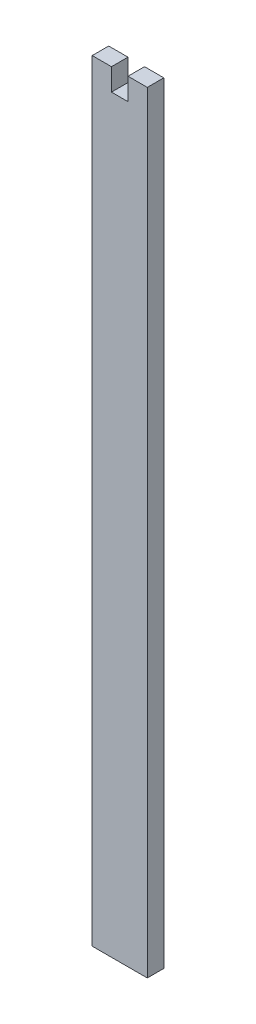
ISO-10303-21;
HEADER;
FILE_DESCRIPTION(('STEP AP214'),'2;1');
FILE_NAME('part.step','',(''),(''),'','','');
FILE_SCHEMA(('AUTOMOTIVE_DESIGN { 1 0 10303 214 1 1 1 1 }'));
ENDSEC;
DATA;
#1=APPLICATION_CONTEXT('core data for automotive mechanical design processes');
#2=APPLICATION_PROTOCOL_DEFINITION('international standard','automotive_design',2000,#1);
#3=PRODUCT_CONTEXT('',#1,'mechanical');
#4=PRODUCT('Part','Part','',(#3));
#5=PRODUCT_RELATED_PRODUCT_CATEGORY('part','',(#4));
#6=PRODUCT_DEFINITION_FORMATION('','',#4);
#7=PRODUCT_DEFINITION_CONTEXT('part definition',#1,'design');
#8=PRODUCT_DEFINITION('design','',#6,#7);
#9=PRODUCT_DEFINITION_SHAPE('','',#8);
#10=(LENGTH_UNIT() NAMED_UNIT(*) SI_UNIT(.MILLI.,.METRE.));
#11=(NAMED_UNIT(*) PLANE_ANGLE_UNIT() SI_UNIT($,.RADIAN.));
#12=(NAMED_UNIT(*) SI_UNIT($,.STERADIAN.) SOLID_ANGLE_UNIT());
#13=UNCERTAINTY_MEASURE_WITH_UNIT(LENGTH_MEASURE(1.E-05),#10,'distance_accuracy_value','');
#14=(GEOMETRIC_REPRESENTATION_CONTEXT(3) GLOBAL_UNCERTAINTY_ASSIGNED_CONTEXT((#13)) GLOBAL_UNIT_ASSIGNED_CONTEXT((#10,
#11,#12)) REPRESENTATION_CONTEXT('',''));
#15=CARTESIAN_POINT('',(0.,0.,0.));
#16=DIRECTION('',(0.,0.,1.));
#17=DIRECTION('',(1.,0.,0.));
#18=AXIS2_PLACEMENT_3D('',#15,#16,#17);
#19=CARTESIAN_POINT('',(4.99999999999999,70.,1.5));
#20=DIRECTION('',(-1.,0.,0.));
#21=DIRECTION('',(0.,-1.,0.));
#22=AXIS2_PLACEMENT_3D('',#19,#20,#21);
#23=PLANE('',#22);
#24=DIRECTION('',(0.,1.,0.));
#25=VECTOR('',#24,1.);
#26=CARTESIAN_POINT('',(4.99999999999999,70.,-1.5));
#27=LINE('',#26,#25);
#28=CARTESIAN_POINT('',(5.00000000000001,-70.,-1.5));
#29=VERTEX_POINT('',#28);
#30=CARTESIAN_POINT('',(4.99999999999999,70.,-1.5));
#31=VERTEX_POINT('',#30);
#32=EDGE_CURVE('E129',#29,#31,#27,.T.);
#33=ORIENTED_EDGE('',*,*,#32,.T.);
#34=DIRECTION('',(0.,0.,-1.));
#35=VECTOR('',#34,1.);
#36=CARTESIAN_POINT('',(4.99999999999999,70.,1.5));
#37=LINE('',#36,#35);
#38=CARTESIAN_POINT('',(4.99999999999999,70.,1.5));
#39=VERTEX_POINT('',#38);
#40=EDGE_CURVE('E11',#39,#31,#37,.T.);
#41=ORIENTED_EDGE('',*,*,#40,.F.);
#42=DIRECTION('',(0.,1.,0.));
#43=VECTOR('',#42,1.);
#44=CARTESIAN_POINT('',(4.99999999999999,70.,1.5));
#45=LINE('',#44,#43);
#46=CARTESIAN_POINT('',(5.00000000000001,-70.,1.5));
#47=VERTEX_POINT('',#46);
#48=EDGE_CURVE('E143',#47,#39,#45,.T.);
#49=ORIENTED_EDGE('',*,*,#48,.F.);
#50=DIRECTION('',(0.,0.,-1.));
#51=VECTOR('',#50,1.);
#52=CARTESIAN_POINT('',(5.00000000000001,-70.,1.5));
#53=LINE('',#52,#51);
#54=EDGE_CURVE('E125',#47,#29,#53,.T.);
#55=ORIENTED_EDGE('',*,*,#54,.T.);
#56=EDGE_LOOP('',(#33,#41,#49,#55));
#57=FACE_BOUND('',#56,.T.);
#58=ADVANCED_FACE('F33',(#57),#23,.F.);
#59=CARTESIAN_POINT('',(1.49999999999999,70.,1.5));
#60=DIRECTION('',(0.,-1.,0.));
#61=DIRECTION('',(0.,0.,-1.));
#62=AXIS2_PLACEMENT_3D('',#59,#60,#61);
#63=PLANE('',#62);
#64=DIRECTION('',(-1.,0.,0.));
#65=VECTOR('',#64,1.);
#66=CARTESIAN_POINT('',(1.49999999999999,70.,-1.5));
#67=LINE('',#66,#65);
#68=CARTESIAN_POINT('',(1.49999999999999,70.,-1.5));
#69=VERTEX_POINT('',#68);
#70=EDGE_CURVE('E132',#31,#69,#67,.T.);
#71=ORIENTED_EDGE('',*,*,#70,.T.);
#72=DIRECTION('',(0.,0.,-1.));
#73=VECTOR('',#72,1.);
#74=CARTESIAN_POINT('',(1.49999999999999,70.,1.5));
#75=LINE('',#74,#73);
#76=CARTESIAN_POINT('',(1.49999999999999,70.,1.5));
#77=VERTEX_POINT('',#76);
#78=EDGE_CURVE('E41',#77,#69,#75,.T.);
#79=ORIENTED_EDGE('',*,*,#78,.F.);
#80=DIRECTION('',(-1.,0.,0.));
#81=VECTOR('',#80,1.);
#82=CARTESIAN_POINT('',(1.49999999999999,70.,1.5));
#83=LINE('',#82,#81);
#84=EDGE_CURVE('E92',#39,#77,#83,.T.);
#85=ORIENTED_EDGE('',*,*,#84,.F.);
#86=ORIENTED_EDGE('',*,*,#40,.T.);
#87=EDGE_LOOP('',(#71,#79,#85,#86));
#88=FACE_BOUND('',#87,.T.);
#89=ADVANCED_FACE('F178',(#88),#63,.F.);
#90=CARTESIAN_POINT('',(1.49999999999999,66.,1.5));
#91=DIRECTION('',(1.,0.,0.));
#92=DIRECTION('',(0.,0.,-1.));
#93=AXIS2_PLACEMENT_3D('',#90,#91,#92);
#94=PLANE('',#93);
#95=DIRECTION('',(0.,-1.,0.));
#96=VECTOR('',#95,1.);
#97=CARTESIAN_POINT('',(1.49999999999999,66.,-1.5));
#98=LINE('',#97,#96);
#99=CARTESIAN_POINT('',(1.49999999999999,66.,-1.5));
#100=VERTEX_POINT('',#99);
#101=EDGE_CURVE('E134',#69,#100,#98,.T.);
#102=ORIENTED_EDGE('',*,*,#101,.T.);
#103=DIRECTION('',(0.,0.,-1.));
#104=VECTOR('',#103,1.);
#105=CARTESIAN_POINT('',(1.49999999999999,66.,1.5));
#106=LINE('',#105,#104);
#107=CARTESIAN_POINT('',(1.49999999999999,66.,1.5));
#108=VERTEX_POINT('',#107);
#109=EDGE_CURVE('E150',#108,#100,#106,.T.);
#110=ORIENTED_EDGE('',*,*,#109,.F.);
#111=DIRECTION('',(0.,-1.,0.));
#112=VECTOR('',#111,1.);
#113=CARTESIAN_POINT('',(1.49999999999999,66.,1.5));
#114=LINE('',#113,#112);
#115=EDGE_CURVE('E158',#77,#108,#114,.T.);
#116=ORIENTED_EDGE('',*,*,#115,.F.);
#117=ORIENTED_EDGE('',*,*,#78,.T.);
#118=EDGE_LOOP('',(#102,#110,#116,#117));
#119=FACE_BOUND('',#118,.T.);
#120=ADVANCED_FACE('F156',(#119),#94,.F.);
#121=CARTESIAN_POINT('',(-1.50000000000001,66.,1.5));
#122=DIRECTION('',(0.,-1.,0.));
#123=DIRECTION('',(0.,0.,-1.));
#124=AXIS2_PLACEMENT_3D('',#121,#122,#123);
#125=PLANE('',#124);
#126=DIRECTION('',(-1.,0.,0.));
#127=VECTOR('',#126,1.);
#128=CARTESIAN_POINT('',(-1.50000000000001,66.,-1.5));
#129=LINE('',#128,#127);
#130=CARTESIAN_POINT('',(-1.50000000000001,66.,-1.5));
#131=VERTEX_POINT('',#130);
#132=EDGE_CURVE('E136',#100,#131,#129,.T.);
#133=ORIENTED_EDGE('',*,*,#132,.T.);
#134=DIRECTION('',(0.,0.,-1.));
#135=VECTOR('',#134,1.);
#136=CARTESIAN_POINT('',(-1.50000000000001,66.,1.5));
#137=LINE('',#136,#135);
#138=CARTESIAN_POINT('',(-1.50000000000001,66.,1.5));
#139=VERTEX_POINT('',#138);
#140=EDGE_CURVE('E147',#139,#131,#137,.T.);
#141=ORIENTED_EDGE('',*,*,#140,.F.);
#142=DIRECTION('',(-1.,0.,0.));
#143=VECTOR('',#142,1.);
#144=CARTESIAN_POINT('',(-1.50000000000001,66.,1.5));
#145=LINE('',#144,#143);
#146=EDGE_CURVE('E170',#108,#139,#145,.T.);
#147=ORIENTED_EDGE('',*,*,#146,.F.);
#148=ORIENTED_EDGE('',*,*,#109,.T.);
#149=EDGE_LOOP('',(#133,#141,#147,#148));
#150=FACE_BOUND('',#149,.T.);
#151=ADVANCED_FACE('F166',(#150),#125,.F.);
#152=CARTESIAN_POINT('',(-1.50000000000001,70.,1.5));
#153=DIRECTION('',(-1.,0.,0.));
#154=DIRECTION('',(0.,0.,1.));
#155=AXIS2_PLACEMENT_3D('',#152,#153,#154);
#156=PLANE('',#155);
#157=DIRECTION('',(0.,1.,0.));
#158=VECTOR('',#157,1.);
#159=CARTESIAN_POINT('',(-1.50000000000001,70.,-1.5));
#160=LINE('',#159,#158);
#161=CARTESIAN_POINT('',(-1.50000000000001,70.,-1.5));
#162=VERTEX_POINT('',#161);
#163=EDGE_CURVE('E138',#131,#162,#160,.T.);
#164=ORIENTED_EDGE('',*,*,#163,.T.);
#165=DIRECTION('',(0.,0.,-1.));
#166=VECTOR('',#165,1.);
#167=CARTESIAN_POINT('',(-1.50000000000001,70.,1.5));
#168=LINE('',#167,#166);
#169=CARTESIAN_POINT('',(-1.50000000000001,70.,1.5));
#170=VERTEX_POINT('',#169);
#171=EDGE_CURVE('E120',#170,#162,#168,.T.);
#172=ORIENTED_EDGE('',*,*,#171,.F.);
#173=DIRECTION('',(0.,1.,0.));
#174=VECTOR('',#173,1.);
#175=CARTESIAN_POINT('',(-1.50000000000001,70.,1.5));
#176=LINE('',#175,#174);
#177=EDGE_CURVE('E111',#139,#170,#176,.T.);
#178=ORIENTED_EDGE('',*,*,#177,.F.);
#179=ORIENTED_EDGE('',*,*,#140,.T.);
#180=EDGE_LOOP('',(#164,#172,#178,#179));
#181=FACE_BOUND('',#180,.T.);
#182=ADVANCED_FACE('F169',(#181),#156,.F.);
#183=CARTESIAN_POINT('',(-5.00000000000001,70.,1.5));
#184=DIRECTION('',(0.,-1.,0.));
#185=DIRECTION('',(0.,0.,-1.));
#186=AXIS2_PLACEMENT_3D('',#183,#184,#185);
#187=PLANE('',#186);
#188=DIRECTION('',(-1.,0.,0.));
#189=VECTOR('',#188,1.);
#190=CARTESIAN_POINT('',(-5.00000000000001,70.,-1.5));
#191=LINE('',#190,#189);
#192=CARTESIAN_POINT('',(-5.00000000000001,70.,-1.5));
#193=VERTEX_POINT('',#192);
#194=EDGE_CURVE('E119',#162,#193,#191,.T.);
#195=ORIENTED_EDGE('',*,*,#194,.T.);
#196=DIRECTION('',(0.,0.,-1.));
#197=VECTOR('',#196,1.);
#198=CARTESIAN_POINT('',(-5.00000000000001,70.,1.5));
#199=LINE('',#198,#197);
#200=CARTESIAN_POINT('',(-5.00000000000001,70.,1.5));
#201=VERTEX_POINT('',#200);
#202=EDGE_CURVE('E116',#201,#193,#199,.T.);
#203=ORIENTED_EDGE('',*,*,#202,.F.);
#204=DIRECTION('',(-1.,0.,0.));
#205=VECTOR('',#204,1.);
#206=CARTESIAN_POINT('',(-5.00000000000001,70.,1.5));
#207=LINE('',#206,#205);
#208=EDGE_CURVE('E105',#170,#201,#207,.T.);
#209=ORIENTED_EDGE('',*,*,#208,.F.);
#210=ORIENTED_EDGE('',*,*,#171,.T.);
#211=EDGE_LOOP('',(#195,#203,#209,#210));
#212=FACE_BOUND('',#211,.T.);
#213=ADVANCED_FACE('F117',(#212),#187,.F.);
#214=CARTESIAN_POINT('',(-5.00000000000001,70.,1.5));
#215=DIRECTION('',(1.,0.,0.));
#216=DIRECTION('',(0.,1.,0.));
#217=AXIS2_PLACEMENT_3D('',#214,#215,#216);
#218=PLANE('',#217);
#219=DIRECTION('',(0.,-1.,0.));
#220=VECTOR('',#219,1.);
#221=CARTESIAN_POINT('',(-5.00000000000001,70.,-1.5));
#222=LINE('',#221,#220);
#223=CARTESIAN_POINT('',(-4.99999999999999,-70.,-1.5));
#224=VERTEX_POINT('',#223);
#225=EDGE_CURVE('E78',#193,#224,#222,.T.);
#226=ORIENTED_EDGE('',*,*,#225,.T.);
#227=DIRECTION('',(0.,0.,-1.));
#228=VECTOR('',#227,1.);
#229=CARTESIAN_POINT('',(-4.99999999999999,-70.,1.5));
#230=LINE('',#229,#228);
#231=CARTESIAN_POINT('',(-4.99999999999999,-70.,1.5));
#232=VERTEX_POINT('',#231);
#233=EDGE_CURVE('E121',#232,#224,#230,.T.);
#234=ORIENTED_EDGE('',*,*,#233,.F.);
#235=DIRECTION('',(0.,-1.,0.));
#236=VECTOR('',#235,1.);
#237=CARTESIAN_POINT('',(-5.00000000000001,70.,1.5));
#238=LINE('',#237,#236);
#239=EDGE_CURVE('E109',#201,#232,#238,.T.);
#240=ORIENTED_EDGE('',*,*,#239,.F.);
#241=ORIENTED_EDGE('',*,*,#202,.T.);
#242=EDGE_LOOP('',(#226,#234,#240,#241));
#243=FACE_BOUND('',#242,.T.);
#244=ADVANCED_FACE('F123',(#243),#218,.F.);
#245=CARTESIAN_POINT('',(-4.99999999999999,-70.,1.5));
#246=DIRECTION('',(0.,1.,0.));
#247=DIRECTION('',(0.,0.,1.));
#248=AXIS2_PLACEMENT_3D('',#245,#246,#247);
#249=PLANE('',#248);
#250=DIRECTION('',(1.,0.,0.));
#251=VECTOR('',#250,1.);
#252=CARTESIAN_POINT('',(-4.99999999999999,-70.,-1.5));
#253=LINE('',#252,#251);
#254=EDGE_CURVE('E84',#224,#29,#253,.T.);
#255=ORIENTED_EDGE('',*,*,#254,.T.);
#256=ORIENTED_EDGE('',*,*,#54,.F.);
#257=DIRECTION('',(1.,0.,0.));
#258=VECTOR('',#257,1.);
#259=CARTESIAN_POINT('',(-4.99999999999999,-70.,1.5));
#260=LINE('',#259,#258);
#261=EDGE_CURVE('E49',#232,#47,#260,.T.);
#262=ORIENTED_EDGE('',*,*,#261,.F.);
#263=ORIENTED_EDGE('',*,*,#233,.T.);
#264=EDGE_LOOP('',(#255,#256,#262,#263));
#265=FACE_BOUND('',#264,.T.);
#266=ADVANCED_FACE('F194',(#265),#249,.F.);
#267=CARTESIAN_POINT('',(0.,0.,1.5));
#268=DIRECTION('',(0.,0.,1.));
#269=DIRECTION('',(1.,0.,0.));
#270=AXIS2_PLACEMENT_3D('',#267,#268,#269);
#271=PLANE('',#270);
#272=ORIENTED_EDGE('',*,*,#48,.T.);
#273=ORIENTED_EDGE('',*,*,#84,.T.);
#274=ORIENTED_EDGE('',*,*,#115,.T.);
#275=ORIENTED_EDGE('',*,*,#146,.T.);
#276=ORIENTED_EDGE('',*,*,#177,.T.);
#277=ORIENTED_EDGE('',*,*,#208,.T.);
#278=ORIENTED_EDGE('',*,*,#239,.T.);
#279=ORIENTED_EDGE('',*,*,#261,.T.);
#280=EDGE_LOOP('',(#272,#273,#274,#275,#276,#277,#278,#279));
#281=FACE_BOUND('',#280,.T.);
#282=ADVANCED_FACE('F107',(#281),#271,.T.);
#283=CARTESIAN_POINT('',(0.,0.,-1.5));
#284=DIRECTION('',(0.,0.,1.));
#285=DIRECTION('',(1.,0.,0.));
#286=AXIS2_PLACEMENT_3D('',#283,#284,#285);
#287=PLANE('',#286);
#288=ORIENTED_EDGE('',*,*,#32,.F.);
#289=ORIENTED_EDGE('',*,*,#254,.F.);
#290=ORIENTED_EDGE('',*,*,#225,.F.);
#291=ORIENTED_EDGE('',*,*,#194,.F.);
#292=ORIENTED_EDGE('',*,*,#163,.F.);
#293=ORIENTED_EDGE('',*,*,#132,.F.);
#294=ORIENTED_EDGE('',*,*,#101,.F.);
#295=ORIENTED_EDGE('',*,*,#70,.F.);
#296=EDGE_LOOP('',(#288,#289,#290,#291,#292,#293,#294,#295));
#297=FACE_BOUND('',#296,.T.);
#298=ADVANCED_FACE('F162',(#297),#287,.F.);
#299=CLOSED_SHELL('',(#58,#89,#120,#151,#182,#213,#244,#266,#282,#298));
#300=MANIFOLD_SOLID_BREP('B2',#299);
#301=ADVANCED_BREP_SHAPE_REPRESENTATION('',(#18,#300),#14);
#302=SHAPE_DEFINITION_REPRESENTATION(#9,#301);
ENDSEC;
END-ISO-10303-21;
